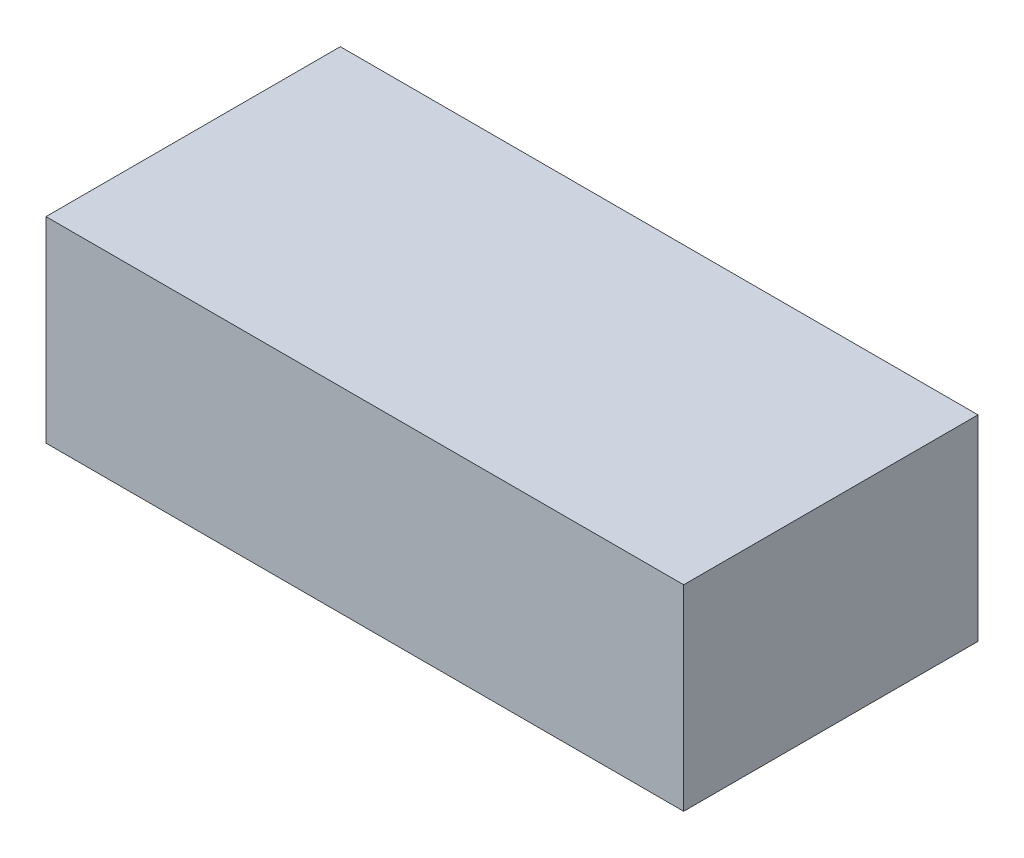
ISO-10303-21;
HEADER;
FILE_DESCRIPTION(('STEP AP214'),'2;1');
FILE_NAME('part.step','',(''),(''),'','','');
FILE_SCHEMA(('AUTOMOTIVE_DESIGN { 1 0 10303 214 1 1 1 1 }'));
ENDSEC;
DATA;
#1=APPLICATION_CONTEXT('core data for automotive mechanical design processes');
#2=APPLICATION_PROTOCOL_DEFINITION('international standard','automotive_design',2000,#1);
#3=PRODUCT_CONTEXT('',#1,'mechanical');
#4=PRODUCT('Part','Part','',(#3));
#5=PRODUCT_RELATED_PRODUCT_CATEGORY('part','',(#4));
#6=PRODUCT_DEFINITION_FORMATION('','',#4);
#7=PRODUCT_DEFINITION_CONTEXT('part definition',#1,'design');
#8=PRODUCT_DEFINITION('design','',#6,#7);
#9=PRODUCT_DEFINITION_SHAPE('','',#8);
#10=(LENGTH_UNIT() NAMED_UNIT(*) SI_UNIT(.MILLI.,.METRE.));
#11=(NAMED_UNIT(*) PLANE_ANGLE_UNIT() SI_UNIT($,.RADIAN.));
#12=(NAMED_UNIT(*) SI_UNIT($,.STERADIAN.) SOLID_ANGLE_UNIT());
#13=UNCERTAINTY_MEASURE_WITH_UNIT(LENGTH_MEASURE(1.E-05),#10,'distance_accuracy_value','');
#14=(GEOMETRIC_REPRESENTATION_CONTEXT(3) GLOBAL_UNCERTAINTY_ASSIGNED_CONTEXT((#13)) GLOBAL_UNIT_ASSIGNED_CONTEXT((#10,
#11,#12)) REPRESENTATION_CONTEXT('',''));
#15=CARTESIAN_POINT('',(0.,0.,0.));
#16=DIRECTION('',(0.,0.,1.));
#17=DIRECTION('',(1.,0.,0.));
#18=AXIS2_PLACEMENT_3D('',#15,#16,#17);
#19=CARTESIAN_POINT('',(-8.25499999999999,5.08,3.81000000000001));
#20=DIRECTION('',(1.,0.,0.));
#21=DIRECTION('',(0.,0.,-1.));
#22=AXIS2_PLACEMENT_3D('',#19,#20,#21);
#23=PLANE('',#22);
#24=DIRECTION('',(0.,0.,1.));
#25=VECTOR('',#24,1.);
#26=CARTESIAN_POINT('',(-8.25499999999999,0.,3.81000000000001));
#27=LINE('',#26,#25);
#28=CARTESIAN_POINT('',(-8.25499999999999,0.,-3.80999999999999));
#29=VERTEX_POINT('',#28);
#30=CARTESIAN_POINT('',(-8.25499999999999,0.,3.81000000000001));
#31=VERTEX_POINT('',#30);
#32=EDGE_CURVE('E94',#29,#31,#27,.T.);
#33=ORIENTED_EDGE('',*,*,#32,.T.);
#34=DIRECTION('',(0.,-1.,0.));
#35=VECTOR('',#34,1.);
#36=CARTESIAN_POINT('',(-8.25499999999999,5.08,3.81000000000001));
#37=LINE('',#36,#35);
#38=CARTESIAN_POINT('',(-8.25499999999999,5.08,3.81000000000001));
#39=VERTEX_POINT('',#38);
#40=EDGE_CURVE('E11',#39,#31,#37,.T.);
#41=ORIENTED_EDGE('',*,*,#40,.F.);
#42=DIRECTION('',(0.,0.,1.));
#43=VECTOR('',#42,1.);
#44=CARTESIAN_POINT('',(-8.25499999999999,5.08,3.81000000000001));
#45=LINE('',#44,#43);
#46=CARTESIAN_POINT('',(-8.25499999999999,5.08,-3.80999999999999));
#47=VERTEX_POINT('',#46);
#48=EDGE_CURVE('E82',#47,#39,#45,.T.);
#49=ORIENTED_EDGE('',*,*,#48,.F.);
#50=DIRECTION('',(0.,-1.,0.));
#51=VECTOR('',#50,1.);
#52=CARTESIAN_POINT('',(-8.25499999999999,5.08,-3.80999999999999));
#53=LINE('',#52,#51);
#54=EDGE_CURVE('E90',#47,#29,#53,.T.);
#55=ORIENTED_EDGE('',*,*,#54,.T.);
#56=EDGE_LOOP('',(#33,#41,#49,#55));
#57=FACE_BOUND('',#56,.T.);
#58=ADVANCED_FACE('F31',(#57),#23,.F.);
#59=CARTESIAN_POINT('',(8.255,5.08,3.81));
#60=DIRECTION('',(0.,0.,-1.));
#61=DIRECTION('',(-1.,0.,0.));
#62=AXIS2_PLACEMENT_3D('',#59,#60,#61);
#63=PLANE('',#62);
#64=DIRECTION('',(1.,0.,0.));
#65=VECTOR('',#64,1.);
#66=CARTESIAN_POINT('',(8.255,0.,3.81));
#67=LINE('',#66,#65);
#68=CARTESIAN_POINT('',(8.255,0.,3.81));
#69=VERTEX_POINT('',#68);
#70=EDGE_CURVE('E86',#31,#69,#67,.T.);
#71=ORIENTED_EDGE('',*,*,#70,.T.);
#72=DIRECTION('',(0.,-1.,0.));
#73=VECTOR('',#72,1.);
#74=CARTESIAN_POINT('',(8.255,5.08,3.81));
#75=LINE('',#74,#73);
#76=CARTESIAN_POINT('',(8.255,5.08,3.81));
#77=VERTEX_POINT('',#76);
#78=EDGE_CURVE('E39',#77,#69,#75,.T.);
#79=ORIENTED_EDGE('',*,*,#78,.F.);
#80=DIRECTION('',(1.,0.,0.));
#81=VECTOR('',#80,1.);
#82=CARTESIAN_POINT('',(8.255,5.08,3.81));
#83=LINE('',#82,#81);
#84=EDGE_CURVE('E77',#39,#77,#83,.T.);
#85=ORIENTED_EDGE('',*,*,#84,.F.);
#86=ORIENTED_EDGE('',*,*,#40,.T.);
#87=EDGE_LOOP('',(#71,#79,#85,#86));
#88=FACE_BOUND('',#87,.T.);
#89=ADVANCED_FACE('F85',(#88),#63,.F.);
#90=CARTESIAN_POINT('',(8.255,5.08,3.81));
#91=DIRECTION('',(-1.,0.,0.));
#92=DIRECTION('',(0.,0.,1.));
#93=AXIS2_PLACEMENT_3D('',#90,#91,#92);
#94=PLANE('',#93);
#95=DIRECTION('',(0.,0.,-1.));
#96=VECTOR('',#95,1.);
#97=CARTESIAN_POINT('',(8.255,0.,3.81));
#98=LINE('',#97,#96);
#99=CARTESIAN_POINT('',(8.255,0.,-3.81));
#100=VERTEX_POINT('',#99);
#101=EDGE_CURVE('E64',#69,#100,#98,.T.);
#102=ORIENTED_EDGE('',*,*,#101,.T.);
#103=DIRECTION('',(0.,-1.,0.));
#104=VECTOR('',#103,1.);
#105=CARTESIAN_POINT('',(8.255,5.08,-3.81));
#106=LINE('',#105,#104);
#107=CARTESIAN_POINT('',(8.255,5.08,-3.81));
#108=VERTEX_POINT('',#107);
#109=EDGE_CURVE('E87',#108,#100,#106,.T.);
#110=ORIENTED_EDGE('',*,*,#109,.F.);
#111=DIRECTION('',(0.,0.,-1.));
#112=VECTOR('',#111,1.);
#113=CARTESIAN_POINT('',(8.255,5.08,3.81));
#114=LINE('',#113,#112);
#115=EDGE_CURVE('E80',#77,#108,#114,.T.);
#116=ORIENTED_EDGE('',*,*,#115,.F.);
#117=ORIENTED_EDGE('',*,*,#78,.T.);
#118=EDGE_LOOP('',(#102,#110,#116,#117));
#119=FACE_BOUND('',#118,.T.);
#120=ADVANCED_FACE('F88',(#119),#94,.F.);
#121=CARTESIAN_POINT('',(8.255,5.08,-3.81));
#122=DIRECTION('',(0.,0.,1.));
#123=DIRECTION('',(1.,0.,0.));
#124=AXIS2_PLACEMENT_3D('',#121,#122,#123);
#125=PLANE('',#124);
#126=DIRECTION('',(-1.,0.,0.));
#127=VECTOR('',#126,1.);
#128=CARTESIAN_POINT('',(8.255,0.,-3.81));
#129=LINE('',#128,#127);
#130=EDGE_CURVE('E70',#100,#29,#129,.T.);
#131=ORIENTED_EDGE('',*,*,#130,.T.);
#132=ORIENTED_EDGE('',*,*,#54,.F.);
#133=DIRECTION('',(-1.,0.,0.));
#134=VECTOR('',#133,1.);
#135=CARTESIAN_POINT('',(8.255,5.08,-3.81));
#136=LINE('',#135,#134);
#137=EDGE_CURVE('E47',#108,#47,#136,.T.);
#138=ORIENTED_EDGE('',*,*,#137,.F.);
#139=ORIENTED_EDGE('',*,*,#109,.T.);
#140=EDGE_LOOP('',(#131,#132,#138,#139));
#141=FACE_BOUND('',#140,.T.);
#142=ADVANCED_FACE('F101',(#141),#125,.F.);
#143=CARTESIAN_POINT('',(-8.25499999999999,5.08,-3.80999999999999));
#144=DIRECTION('',(0.,1.,0.));
#145=DIRECTION('',(0.,0.,1.));
#146=AXIS2_PLACEMENT_3D('',#143,#144,#145);
#147=PLANE('',#146);
#148=ORIENTED_EDGE('',*,*,#48,.T.);
#149=ORIENTED_EDGE('',*,*,#84,.T.);
#150=ORIENTED_EDGE('',*,*,#115,.T.);
#151=ORIENTED_EDGE('',*,*,#137,.T.);
#152=EDGE_LOOP('',(#148,#149,#150,#151));
#153=FACE_BOUND('',#152,.T.);
#154=ADVANCED_FACE('F78',(#153),#147,.T.);
#155=CARTESIAN_POINT('',(-8.25499999999999,0.,-3.80999999999999));
#156=DIRECTION('',(0.,1.,0.));
#157=DIRECTION('',(0.,0.,1.));
#158=AXIS2_PLACEMENT_3D('',#155,#156,#157);
#159=PLANE('',#158);
#160=ORIENTED_EDGE('',*,*,#32,.F.);
#161=ORIENTED_EDGE('',*,*,#130,.F.);
#162=ORIENTED_EDGE('',*,*,#101,.F.);
#163=ORIENTED_EDGE('',*,*,#70,.F.);
#164=EDGE_LOOP('',(#160,#161,#162,#163));
#165=FACE_BOUND('',#164,.T.);
#166=ADVANCED_FACE('F104',(#165),#159,.F.);
#167=CLOSED_SHELL('',(#58,#89,#120,#142,#154,#166));
#168=MANIFOLD_SOLID_BREP('B2',#167);
#169=ADVANCED_BREP_SHAPE_REPRESENTATION('',(#18,#168),#14);
#170=SHAPE_DEFINITION_REPRESENTATION(#9,#169);
ENDSEC;
END-ISO-10303-21;
